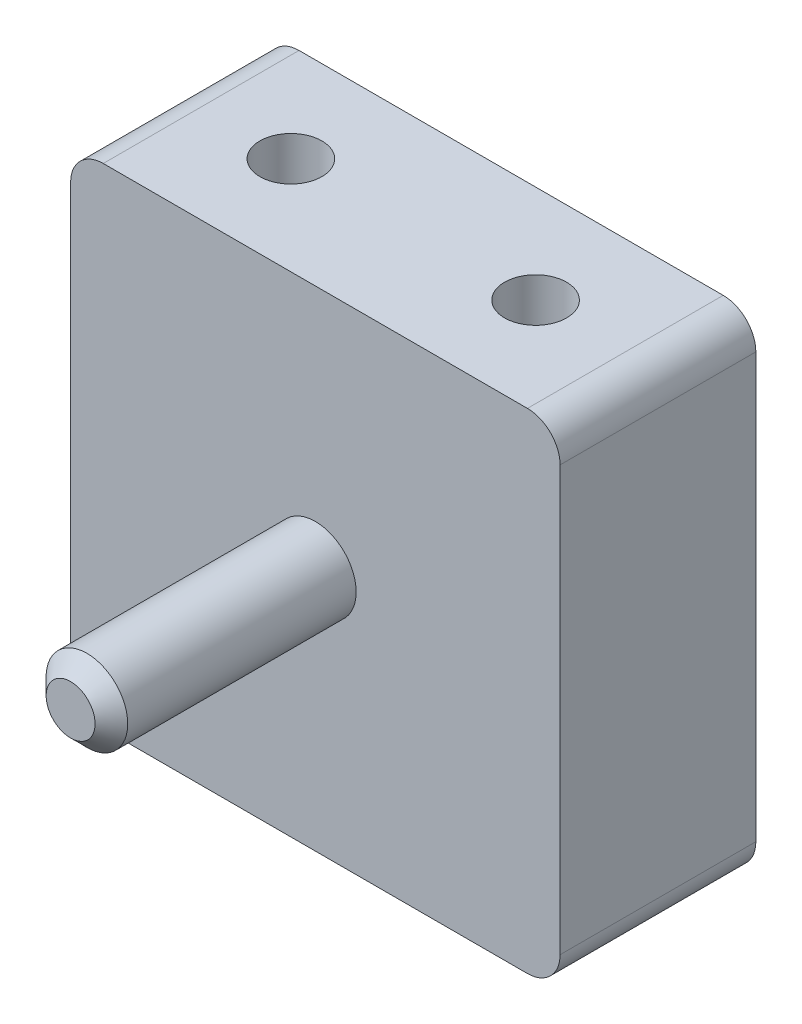
ISO-10303-21;
HEADER;
FILE_DESCRIPTION(('STEP AP214'),'2;1');
FILE_NAME('part.step','',(''),(''),'','','');
FILE_SCHEMA(('AUTOMOTIVE_DESIGN { 1 0 10303 214 1 1 1 1 }'));
ENDSEC;
DATA;
#1=APPLICATION_CONTEXT('core data for automotive mechanical design processes');
#2=APPLICATION_PROTOCOL_DEFINITION('international standard','automotive_design',2000,#1);
#3=PRODUCT_CONTEXT('',#1,'mechanical');
#4=PRODUCT('Part','Part','',(#3));
#5=PRODUCT_RELATED_PRODUCT_CATEGORY('part','',(#4));
#6=PRODUCT_DEFINITION_FORMATION('','',#4);
#7=PRODUCT_DEFINITION_CONTEXT('part definition',#1,'design');
#8=PRODUCT_DEFINITION('design','',#6,#7);
#9=PRODUCT_DEFINITION_SHAPE('','',#8);
#10=(LENGTH_UNIT() NAMED_UNIT(*) SI_UNIT(.MILLI.,.METRE.));
#11=(NAMED_UNIT(*) PLANE_ANGLE_UNIT() SI_UNIT($,.RADIAN.));
#12=(NAMED_UNIT(*) SI_UNIT($,.STERADIAN.) SOLID_ANGLE_UNIT());
#13=UNCERTAINTY_MEASURE_WITH_UNIT(LENGTH_MEASURE(1.E-05),#10,'distance_accuracy_value','');
#14=(GEOMETRIC_REPRESENTATION_CONTEXT(3) GLOBAL_UNCERTAINTY_ASSIGNED_CONTEXT((#13)) GLOBAL_UNIT_ASSIGNED_CONTEXT((#10,
#11,#12)) REPRESENTATION_CONTEXT('',''));
#15=CARTESIAN_POINT('',(0.,0.,0.));
#16=DIRECTION('',(0.,0.,1.));
#17=DIRECTION('',(1.,0.,0.));
#18=AXIS2_PLACEMENT_3D('',#15,#16,#17);
#19=CARTESIAN_POINT('',(0.,0.,15.24));
#20=DIRECTION('',(0.,0.,1.));
#21=DIRECTION('',(1.,0.,0.));
#22=AXIS2_PLACEMENT_3D('',#19,#20,#21);
#23=PLANE('',#22);
#24=CARTESIAN_POINT('',(0.,0.,15.24));
#25=DIRECTION('',(0.,0.,1.));
#26=DIRECTION('',(1.,0.,0.));
#27=AXIS2_PLACEMENT_3D('',#24,#25,#26);
#28=CIRCLE('',#27,3.175);
#29=CARTESIAN_POINT('',(3.175,0.,15.24));
#30=VERTEX_POINT('',#29);
#31=EDGE_CURVE('E251',#30,#30,#28,.T.);
#32=ORIENTED_EDGE('',*,*,#31,.F.);
#33=EDGE_LOOP('',(#32));
#34=FACE_BOUND('',#33,.T.);
#35=DIRECTION('',(0.,-1.,0.));
#36=VECTOR('',#35,1.);
#37=CARTESIAN_POINT('',(-19.05,-19.05,15.24));
#38=LINE('',#37,#36);
#39=CARTESIAN_POINT('',(-19.05,16.51,15.24));
#40=VERTEX_POINT('',#39);
#41=CARTESIAN_POINT('',(-19.05,-16.51,15.24));
#42=VERTEX_POINT('',#41);
#43=EDGE_CURVE('E150',#40,#42,#38,.T.);
#44=ORIENTED_EDGE('',*,*,#43,.T.);
#45=CARTESIAN_POINT('',(-16.51,-16.51,15.24));
#46=DIRECTION('',(0.,0.,1.));
#47=DIRECTION('',(1.,0.,0.));
#48=AXIS2_PLACEMENT_3D('',#45,#46,#47);
#49=CIRCLE('',#48,2.54);
#50=CARTESIAN_POINT('',(-16.51,-19.05,15.24));
#51=VERTEX_POINT('',#50);
#52=EDGE_CURVE('E165',#42,#51,#49,.T.);
#53=ORIENTED_EDGE('',*,*,#52,.T.);
#54=DIRECTION('',(1.,0.,0.));
#55=VECTOR('',#54,1.);
#56=CARTESIAN_POINT('',(19.05,-19.05,15.24));
#57=LINE('',#56,#55);
#58=CARTESIAN_POINT('',(16.51,-19.05,15.24));
#59=VERTEX_POINT('',#58);
#60=EDGE_CURVE('E132',#51,#59,#57,.T.);
#61=ORIENTED_EDGE('',*,*,#60,.T.);
#62=CARTESIAN_POINT('',(16.51,-16.51,15.24));
#63=DIRECTION('',(0.,0.,1.));
#64=DIRECTION('',(1.,0.,0.));
#65=AXIS2_PLACEMENT_3D('',#62,#63,#64);
#66=CIRCLE('',#65,2.54);
#67=CARTESIAN_POINT('',(19.05,-16.51,15.24));
#68=VERTEX_POINT('',#67);
#69=EDGE_CURVE('E163',#59,#68,#66,.T.);
#70=ORIENTED_EDGE('',*,*,#69,.T.);
#71=DIRECTION('',(0.,1.,0.));
#72=VECTOR('',#71,1.);
#73=CARTESIAN_POINT('',(19.05,-19.05,15.24));
#74=LINE('',#73,#72);
#75=CARTESIAN_POINT('',(19.05,16.51,15.24));
#76=VERTEX_POINT('',#75);
#77=EDGE_CURVE('E239',#68,#76,#74,.T.);
#78=ORIENTED_EDGE('',*,*,#77,.T.);
#79=CARTESIAN_POINT('',(16.51,16.51,15.24));
#80=DIRECTION('',(0.,0.,1.));
#81=DIRECTION('',(1.,0.,0.));
#82=AXIS2_PLACEMENT_3D('',#79,#80,#81);
#83=CIRCLE('',#82,2.54);
#84=CARTESIAN_POINT('',(16.51,19.05,15.24));
#85=VERTEX_POINT('',#84);
#86=EDGE_CURVE('E67',#76,#85,#83,.T.);
#87=ORIENTED_EDGE('',*,*,#86,.T.);
#88=DIRECTION('',(-1.,0.,0.));
#89=VECTOR('',#88,1.);
#90=CARTESIAN_POINT('',(19.05,19.05,15.24));
#91=LINE('',#90,#89);
#92=CARTESIAN_POINT('',(-16.51,19.05,15.24));
#93=VERTEX_POINT('',#92);
#94=EDGE_CURVE('E151',#85,#93,#91,.T.);
#95=ORIENTED_EDGE('',*,*,#94,.T.);
#96=CARTESIAN_POINT('',(-16.51,16.51,15.24));
#97=DIRECTION('',(0.,0.,1.));
#98=DIRECTION('',(1.,0.,0.));
#99=AXIS2_PLACEMENT_3D('',#96,#97,#98);
#100=CIRCLE('',#99,2.54);
#101=EDGE_CURVE('E160',#93,#40,#100,.T.);
#102=ORIENTED_EDGE('',*,*,#101,.T.);
#103=EDGE_LOOP('',(#44,#53,#61,#70,#78,#87,#95,#102));
#104=FACE_BOUND('',#103,.T.);
#105=ADVANCED_FACE('F45',(#34,#104),#23,.T.);
#106=CARTESIAN_POINT('',(0.,0.,0.));
#107=DIRECTION('',(0.,0.,1.));
#108=DIRECTION('',(1.,0.,0.));
#109=AXIS2_PLACEMENT_3D('',#106,#107,#108);
#110=PLANE('',#109);
#111=DIRECTION('',(1.,0.,0.));
#112=VECTOR('',#111,1.);
#113=CARTESIAN_POINT('',(19.05,-19.05,0.));
#114=LINE('',#113,#112);
#115=CARTESIAN_POINT('',(-16.51,-19.05,0.));
#116=VERTEX_POINT('',#115);
#117=CARTESIAN_POINT('',(16.51,-19.05,0.));
#118=VERTEX_POINT('',#117);
#119=EDGE_CURVE('E129',#116,#118,#114,.T.);
#120=ORIENTED_EDGE('',*,*,#119,.F.);
#121=CARTESIAN_POINT('',(-16.51,-16.51,0.));
#122=DIRECTION('',(0.,0.,1.));
#123=DIRECTION('',(1.,0.,0.));
#124=AXIS2_PLACEMENT_3D('',#121,#122,#123);
#125=CIRCLE('',#124,2.54);
#126=CARTESIAN_POINT('',(-19.05,-16.51,0.));
#127=VERTEX_POINT('',#126);
#128=EDGE_CURVE('E112',#116,#127,#125,.F.);
#129=ORIENTED_EDGE('',*,*,#128,.T.);
#130=DIRECTION('',(0.,-1.,0.));
#131=VECTOR('',#130,1.);
#132=CARTESIAN_POINT('',(-19.05,-19.05,0.));
#133=LINE('',#132,#131);
#134=CARTESIAN_POINT('',(-19.05,16.51,0.));
#135=VERTEX_POINT('',#134);
#136=EDGE_CURVE('E140',#135,#127,#133,.T.);
#137=ORIENTED_EDGE('',*,*,#136,.F.);
#138=CARTESIAN_POINT('',(-16.51,16.51,0.));
#139=DIRECTION('',(0.,0.,1.));
#140=DIRECTION('',(1.,0.,0.));
#141=AXIS2_PLACEMENT_3D('',#138,#139,#140);
#142=CIRCLE('',#141,2.54);
#143=CARTESIAN_POINT('',(-16.51,19.05,0.));
#144=VERTEX_POINT('',#143);
#145=EDGE_CURVE('E133',#135,#144,#142,.F.);
#146=ORIENTED_EDGE('',*,*,#145,.T.);
#147=DIRECTION('',(-1.,0.,0.));
#148=VECTOR('',#147,1.);
#149=CARTESIAN_POINT('',(19.05,19.05,0.));
#150=LINE('',#149,#148);
#151=CARTESIAN_POINT('',(16.51,19.05,0.));
#152=VERTEX_POINT('',#151);
#153=EDGE_CURVE('E143',#152,#144,#150,.T.);
#154=ORIENTED_EDGE('',*,*,#153,.F.);
#155=CARTESIAN_POINT('',(16.51,16.51,0.));
#156=DIRECTION('',(0.,0.,1.));
#157=DIRECTION('',(1.,0.,0.));
#158=AXIS2_PLACEMENT_3D('',#155,#156,#157);
#159=CIRCLE('',#158,2.54);
#160=CARTESIAN_POINT('',(19.05,16.51,0.));
#161=VERTEX_POINT('',#160);
#162=EDGE_CURVE('E154',#152,#161,#159,.F.);
#163=ORIENTED_EDGE('',*,*,#162,.T.);
#164=DIRECTION('',(0.,1.,0.));
#165=VECTOR('',#164,1.);
#166=CARTESIAN_POINT('',(19.05,-19.05,0.));
#167=LINE('',#166,#165);
#168=CARTESIAN_POINT('',(19.05,-16.51,0.));
#169=VERTEX_POINT('',#168);
#170=EDGE_CURVE('E139',#169,#161,#167,.T.);
#171=ORIENTED_EDGE('',*,*,#170,.F.);
#172=CARTESIAN_POINT('',(16.51,-16.51,0.));
#173=DIRECTION('',(0.,0.,1.));
#174=DIRECTION('',(1.,0.,0.));
#175=AXIS2_PLACEMENT_3D('',#172,#173,#174);
#176=CIRCLE('',#175,2.54);
#177=EDGE_CURVE('E123',#169,#118,#176,.F.);
#178=ORIENTED_EDGE('',*,*,#177,.T.);
#179=EDGE_LOOP('',(#120,#129,#137,#146,#154,#163,#171,#178));
#180=FACE_BOUND('',#179,.T.);
#181=CARTESIAN_POINT('',(0.,0.,0.));
#182=DIRECTION('',(0.,0.,1.));
#183=DIRECTION('',(1.,0.,0.));
#184=AXIS2_PLACEMENT_3D('',#181,#182,#183);
#185=CIRCLE('',#184,1.5875);
#186=CARTESIAN_POINT('',(1.5875,0.,0.));
#187=VERTEX_POINT('',#186);
#188=EDGE_CURVE('E145',#187,#187,#185,.T.);
#189=ORIENTED_EDGE('',*,*,#188,.T.);
#190=EDGE_LOOP('',(#189));
#191=FACE_BOUND('',#190,.T.);
#192=ADVANCED_FACE('F136',(#180,#191),#110,.F.);
#193=CARTESIAN_POINT('',(-19.05,-19.05,15.24));
#194=DIRECTION('',(1.,0.,0.));
#195=DIRECTION('',(0.,0.,-1.));
#196=AXIS2_PLACEMENT_3D('',#193,#194,#195);
#197=PLANE('',#196);
#198=ORIENTED_EDGE('',*,*,#136,.T.);
#199=DIRECTION('',(0.,0.,-1.));
#200=VECTOR('',#199,1.);
#201=CARTESIAN_POINT('',(-19.05,-16.51,15.24));
#202=LINE('',#201,#200);
#203=EDGE_CURVE('E117',#127,#42,#202,.F.);
#204=ORIENTED_EDGE('',*,*,#203,.T.);
#205=ORIENTED_EDGE('',*,*,#43,.F.);
#206=DIRECTION('',(0.,0.,-1.));
#207=VECTOR('',#206,1.);
#208=CARTESIAN_POINT('',(-19.05,16.51,15.24));
#209=LINE('',#208,#207);
#210=EDGE_CURVE('E122',#40,#135,#209,.T.);
#211=ORIENTED_EDGE('',*,*,#210,.T.);
#212=EDGE_LOOP('',(#198,#204,#205,#211));
#213=FACE_BOUND('',#212,.T.);
#214=ADVANCED_FACE('F200',(#213),#197,.F.);
#215=CARTESIAN_POINT('',(19.05,-19.05,15.24));
#216=DIRECTION('',(0.,1.,0.));
#217=DIRECTION('',(-1.,0.,0.));
#218=AXIS2_PLACEMENT_3D('',#215,#216,#217);
#219=PLANE('',#218);
#220=CARTESIAN_POINT('',(-9.525,-19.05,7.62));
#221=DIRECTION('',(0.,-1.,0.));
#222=DIRECTION('',(1.,0.,0.));
#223=AXIS2_PLACEMENT_3D('',#220,#221,#222);
#224=CIRCLE('',#223,2.413);
#225=CARTESIAN_POINT('',(-7.112,-19.05,7.62));
#226=VERTEX_POINT('',#225);
#227=EDGE_CURVE('E262',#226,#226,#224,.T.);
#228=ORIENTED_EDGE('',*,*,#227,.F.);
#229=EDGE_LOOP('',(#228));
#230=FACE_BOUND('',#229,.T.);
#231=CARTESIAN_POINT('',(9.525,-19.05,7.62));
#232=DIRECTION('',(0.,-1.,0.));
#233=DIRECTION('',(1.,0.,0.));
#234=AXIS2_PLACEMENT_3D('',#231,#232,#233);
#235=CIRCLE('',#234,2.413);
#236=CARTESIAN_POINT('',(11.938,-19.05,7.62));
#237=VERTEX_POINT('',#236);
#238=EDGE_CURVE('E258',#237,#237,#235,.T.);
#239=ORIENTED_EDGE('',*,*,#238,.F.);
#240=EDGE_LOOP('',(#239));
#241=FACE_BOUND('',#240,.T.);
#242=ORIENTED_EDGE('',*,*,#60,.F.);
#243=DIRECTION('',(0.,0.,-1.));
#244=VECTOR('',#243,1.);
#245=CARTESIAN_POINT('',(-16.51,-19.05,15.24));
#246=LINE('',#245,#244);
#247=EDGE_CURVE('E116',#51,#116,#246,.T.);
#248=ORIENTED_EDGE('',*,*,#247,.T.);
#249=ORIENTED_EDGE('',*,*,#119,.T.);
#250=DIRECTION('',(0.,0.,-1.));
#251=VECTOR('',#250,1.);
#252=CARTESIAN_POINT('',(16.51,-19.05,15.24));
#253=LINE('',#252,#251);
#254=EDGE_CURVE('E134',#118,#59,#253,.F.);
#255=ORIENTED_EDGE('',*,*,#254,.T.);
#256=EDGE_LOOP('',(#242,#248,#249,#255));
#257=FACE_BOUND('',#256,.T.);
#258=ADVANCED_FACE('F128',(#230,#241,#257),#219,.F.);
#259=CARTESIAN_POINT('',(19.05,-19.05,15.24));
#260=DIRECTION('',(-1.,0.,0.));
#261=DIRECTION('',(0.,0.,1.));
#262=AXIS2_PLACEMENT_3D('',#259,#260,#261);
#263=PLANE('',#262);
#264=ORIENTED_EDGE('',*,*,#77,.F.);
#265=DIRECTION('',(0.,0.,-1.));
#266=VECTOR('',#265,1.);
#267=CARTESIAN_POINT('',(19.05,-16.51,15.24));
#268=LINE('',#267,#266);
#269=EDGE_CURVE('E169',#68,#169,#268,.T.);
#270=ORIENTED_EDGE('',*,*,#269,.T.);
#271=ORIENTED_EDGE('',*,*,#170,.T.);
#272=DIRECTION('',(0.,0.,-1.));
#273=VECTOR('',#272,1.);
#274=CARTESIAN_POINT('',(19.05,16.51,15.24));
#275=LINE('',#274,#273);
#276=EDGE_CURVE('E167',#161,#76,#275,.F.);
#277=ORIENTED_EDGE('',*,*,#276,.T.);
#278=EDGE_LOOP('',(#264,#270,#271,#277));
#279=FACE_BOUND('',#278,.T.);
#280=ADVANCED_FACE('F210',(#279),#263,.F.);
#281=CARTESIAN_POINT('',(19.05,19.05,15.24));
#282=DIRECTION('',(0.,-1.,0.));
#283=DIRECTION('',(1.,0.,0.));
#284=AXIS2_PLACEMENT_3D('',#281,#282,#283);
#285=PLANE('',#284);
#286=CARTESIAN_POINT('',(9.525,19.05,7.62));
#287=DIRECTION('',(0.,1.,0.));
#288=DIRECTION('',(-1.,0.,0.));
#289=AXIS2_PLACEMENT_3D('',#286,#287,#288);
#290=CIRCLE('',#289,2.413);
#291=CARTESIAN_POINT('',(7.112,19.05,7.62));
#292=VERTEX_POINT('',#291);
#293=EDGE_CURVE('E273',#292,#292,#290,.T.);
#294=ORIENTED_EDGE('',*,*,#293,.F.);
#295=EDGE_LOOP('',(#294));
#296=FACE_BOUND('',#295,.T.);
#297=CARTESIAN_POINT('',(-9.525,19.05,7.62));
#298=DIRECTION('',(0.,1.,0.));
#299=DIRECTION('',(-1.,0.,0.));
#300=AXIS2_PLACEMENT_3D('',#297,#298,#299);
#301=CIRCLE('',#300,2.413);
#302=CARTESIAN_POINT('',(-11.938,19.05,7.62));
#303=VERTEX_POINT('',#302);
#304=EDGE_CURVE('E270',#303,#303,#301,.T.);
#305=ORIENTED_EDGE('',*,*,#304,.F.);
#306=EDGE_LOOP('',(#305));
#307=FACE_BOUND('',#306,.T.);
#308=ORIENTED_EDGE('',*,*,#94,.F.);
#309=DIRECTION('',(0.,0.,-1.));
#310=VECTOR('',#309,1.);
#311=CARTESIAN_POINT('',(16.51,19.05,15.24));
#312=LINE('',#311,#310);
#313=EDGE_CURVE('E173',#85,#152,#312,.T.);
#314=ORIENTED_EDGE('',*,*,#313,.T.);
#315=ORIENTED_EDGE('',*,*,#153,.T.);
#316=DIRECTION('',(0.,0.,-1.));
#317=VECTOR('',#316,1.);
#318=CARTESIAN_POINT('',(-16.51,19.05,15.24));
#319=LINE('',#318,#317);
#320=EDGE_CURVE('E60',#144,#93,#319,.F.);
#321=ORIENTED_EDGE('',*,*,#320,.T.);
#322=EDGE_LOOP('',(#308,#314,#315,#321));
#323=FACE_BOUND('',#322,.T.);
#324=ADVANCED_FACE('F207',(#296,#307,#323),#285,.F.);
#325=CARTESIAN_POINT('',(0.,0.,15.24));
#326=DIRECTION('',(0.,0.,-1.));
#327=DIRECTION('',(-1.,0.,0.));
#328=AXIS2_PLACEMENT_3D('',#325,#326,#327);
#329=CYLINDRICAL_SURFACE('',#328,1.5875);
#330=CARTESIAN_POINT('',(0.,0.,15.24));
#331=DIRECTION('',(0.,0.,1.));
#332=DIRECTION('',(1.,0.,0.));
#333=AXIS2_PLACEMENT_3D('',#330,#331,#332);
#334=CIRCLE('',#333,1.5875);
#335=CARTESIAN_POINT('',(1.5875,0.,15.24));
#336=VERTEX_POINT('',#335);
#337=EDGE_CURVE('E248',#336,#336,#334,.T.);
#338=ORIENTED_EDGE('',*,*,#337,.T.);
#339=EDGE_LOOP('',(#338));
#340=FACE_BOUND('',#339,.T.);
#341=ORIENTED_EDGE('',*,*,#188,.F.);
#342=EDGE_LOOP('',(#341));
#343=FACE_BOUND('',#342,.T.);
#344=ADVANCED_FACE('F204',(#340,#343),#329,.F.);
#345=CARTESIAN_POINT('',(0.,0.,15.24));
#346=DIRECTION('',(0.,0.,1.));
#347=DIRECTION('',(1.,0.,0.));
#348=AXIS2_PLACEMENT_3D('',#345,#346,#347);
#349=PLANE('',#348);
#350=ORIENTED_EDGE('',*,*,#337,.F.);
#351=EDGE_LOOP('',(#350));
#352=FACE_BOUND('',#351,.T.);
#353=ADVANCED_FACE('F316',(#352),#349,.F.);
#354=CARTESIAN_POINT('',(0.,0.,34.29));
#355=DIRECTION('',(0.,0.,-1.));
#356=DIRECTION('',(-1.,0.,0.));
#357=AXIS2_PLACEMENT_3D('',#354,#355,#356);
#358=CYLINDRICAL_SURFACE('',#357,3.175);
#359=CARTESIAN_POINT('',(0.,0.,33.02));
#360=DIRECTION('',(0.,0.,1.));
#361=DIRECTION('',(1.,0.,0.));
#362=AXIS2_PLACEMENT_3D('',#359,#360,#361);
#363=CIRCLE('',#362,3.175);
#364=CARTESIAN_POINT('',(3.175,0.,33.02));
#365=VERTEX_POINT('',#364);
#366=EDGE_CURVE('E13',#365,#365,#363,.F.);
#367=ORIENTED_EDGE('',*,*,#366,.T.);
#368=EDGE_LOOP('',(#367));
#369=FACE_BOUND('',#368,.T.);
#370=ORIENTED_EDGE('',*,*,#31,.T.);
#371=EDGE_LOOP('',(#370));
#372=FACE_BOUND('',#371,.T.);
#373=ADVANCED_FACE('F315',(#369,#372),#358,.T.);
#374=CARTESIAN_POINT('',(0.,0.,34.29));
#375=DIRECTION('',(0.,0.,1.));
#376=DIRECTION('',(1.,0.,0.));
#377=AXIS2_PLACEMENT_3D('',#374,#375,#376);
#378=PLANE('',#377);
#379=CARTESIAN_POINT('',(0.,0.,34.29));
#380=DIRECTION('',(0.,0.,1.));
#381=DIRECTION('',(1.,0.,0.));
#382=AXIS2_PLACEMENT_3D('',#379,#380,#381);
#383=CIRCLE('',#382,1.90500000000002);
#384=CARTESIAN_POINT('',(1.90500000000002,0.,34.29));
#385=VERTEX_POINT('',#384);
#386=EDGE_CURVE('E53',#385,#385,#383,.T.);
#387=ORIENTED_EDGE('',*,*,#386,.T.);
#388=EDGE_LOOP('',(#387));
#389=FACE_BOUND('',#388,.T.);
#390=ADVANCED_FACE('F178',(#389),#378,.T.);
#391=CARTESIAN_POINT('',(-16.51,-16.51,15.24));
#392=DIRECTION('',(0.,0.,-1.));
#393=DIRECTION('',(-1.,0.,0.));
#394=AXIS2_PLACEMENT_3D('',#391,#392,#393);
#395=CYLINDRICAL_SURFACE('',#394,2.54);
#396=ORIENTED_EDGE('',*,*,#52,.F.);
#397=ORIENTED_EDGE('',*,*,#203,.F.);
#398=ORIENTED_EDGE('',*,*,#128,.F.);
#399=ORIENTED_EDGE('',*,*,#247,.F.);
#400=EDGE_LOOP('',(#396,#397,#398,#399));
#401=FACE_BOUND('',#400,.T.);
#402=ADVANCED_FACE('F115',(#401),#395,.T.);
#403=CARTESIAN_POINT('',(16.51,-16.51,15.24));
#404=DIRECTION('',(0.,0.,-1.));
#405=DIRECTION('',(-1.,0.,0.));
#406=AXIS2_PLACEMENT_3D('',#403,#404,#405);
#407=CYLINDRICAL_SURFACE('',#406,2.54);
#408=ORIENTED_EDGE('',*,*,#69,.F.);
#409=ORIENTED_EDGE('',*,*,#254,.F.);
#410=ORIENTED_EDGE('',*,*,#177,.F.);
#411=ORIENTED_EDGE('',*,*,#269,.F.);
#412=EDGE_LOOP('',(#408,#409,#410,#411));
#413=FACE_BOUND('',#412,.T.);
#414=ADVANCED_FACE('F223',(#413),#407,.T.);
#415=CARTESIAN_POINT('',(16.51,16.51,15.24));
#416=DIRECTION('',(0.,0.,-1.));
#417=DIRECTION('',(-1.,0.,0.));
#418=AXIS2_PLACEMENT_3D('',#415,#416,#417);
#419=CYLINDRICAL_SURFACE('',#418,2.54);
#420=ORIENTED_EDGE('',*,*,#86,.F.);
#421=ORIENTED_EDGE('',*,*,#276,.F.);
#422=ORIENTED_EDGE('',*,*,#162,.F.);
#423=ORIENTED_EDGE('',*,*,#313,.F.);
#424=EDGE_LOOP('',(#420,#421,#422,#423));
#425=FACE_BOUND('',#424,.T.);
#426=ADVANCED_FACE('F191',(#425),#419,.T.);
#427=CARTESIAN_POINT('',(-16.51,16.51,15.24));
#428=DIRECTION('',(0.,0.,-1.));
#429=DIRECTION('',(-1.,0.,0.));
#430=AXIS2_PLACEMENT_3D('',#427,#428,#429);
#431=CYLINDRICAL_SURFACE('',#430,2.54);
#432=ORIENTED_EDGE('',*,*,#101,.F.);
#433=ORIENTED_EDGE('',*,*,#320,.F.);
#434=ORIENTED_EDGE('',*,*,#145,.F.);
#435=ORIENTED_EDGE('',*,*,#210,.F.);
#436=EDGE_LOOP('',(#432,#433,#434,#435));
#437=FACE_BOUND('',#436,.T.);
#438=ADVANCED_FACE('F182',(#437),#431,.T.);
#439=CARTESIAN_POINT('',(0.,0.,34.29));
#440=DIRECTION('',(0.,0.,-1.));
#441=DIRECTION('',(-1.,0.,0.));
#442=AXIS2_PLACEMENT_3D('',#439,#440,#441);
#443=CONICAL_SURFACE('',#442,1.90500000000002,0.785398163397447);
#444=ORIENTED_EDGE('',*,*,#366,.F.);
#445=EDGE_LOOP('',(#444));
#446=FACE_BOUND('',#445,.T.);
#447=ORIENTED_EDGE('',*,*,#386,.F.);
#448=EDGE_LOOP('',(#447));
#449=FACE_BOUND('',#448,.T.);
#450=ADVANCED_FACE('F47',(#446,#449),#443,.T.);
#451=CARTESIAN_POINT('',(9.525,-11.43,7.62));
#452=DIRECTION('',(0.,-1.,0.));
#453=DIRECTION('',(1.,0.,0.));
#454=AXIS2_PLACEMENT_3D('',#451,#452,#453);
#455=CYLINDRICAL_SURFACE('',#454,2.413);
#456=CARTESIAN_POINT('',(9.525,-11.43,7.62));
#457=DIRECTION('',(0.,-1.,0.));
#458=DIRECTION('',(1.,0.,0.));
#459=AXIS2_PLACEMENT_3D('',#456,#457,#458);
#460=CIRCLE('',#459,2.413);
#461=CARTESIAN_POINT('',(11.938,-11.43,7.62));
#462=VERTEX_POINT('',#461);
#463=EDGE_CURVE('E255',#462,#462,#460,.T.);
#464=ORIENTED_EDGE('',*,*,#463,.F.);
#465=EDGE_LOOP('',(#464));
#466=FACE_BOUND('',#465,.T.);
#467=ORIENTED_EDGE('',*,*,#238,.T.);
#468=EDGE_LOOP('',(#467));
#469=FACE_BOUND('',#468,.T.);
#470=ADVANCED_FACE('F181',(#466,#469),#455,.F.);
#471=CARTESIAN_POINT('',(9.525,-11.43,7.62));
#472=DIRECTION('',(0.,-1.,0.));
#473=DIRECTION('',(1.,0.,0.));
#474=AXIS2_PLACEMENT_3D('',#471,#472,#473);
#475=PLANE('',#474);
#476=ORIENTED_EDGE('',*,*,#463,.T.);
#477=EDGE_LOOP('',(#476));
#478=FACE_BOUND('',#477,.T.);
#479=ADVANCED_FACE('F188',(#478),#475,.T.);
#480=CARTESIAN_POINT('',(-9.525,-11.43,7.62));
#481=DIRECTION('',(0.,-1.,0.));
#482=DIRECTION('',(1.,0.,0.));
#483=AXIS2_PLACEMENT_3D('',#480,#481,#482);
#484=CYLINDRICAL_SURFACE('',#483,2.413);
#485=CARTESIAN_POINT('',(-9.525,-11.43,7.62));
#486=DIRECTION('',(0.,-1.,0.));
#487=DIRECTION('',(1.,0.,0.));
#488=AXIS2_PLACEMENT_3D('',#485,#486,#487);
#489=CIRCLE('',#488,2.413);
#490=CARTESIAN_POINT('',(-7.112,-11.43,7.62));
#491=VERTEX_POINT('',#490);
#492=EDGE_CURVE('E254',#491,#491,#489,.T.);
#493=ORIENTED_EDGE('',*,*,#492,.F.);
#494=EDGE_LOOP('',(#493));
#495=FACE_BOUND('',#494,.T.);
#496=ORIENTED_EDGE('',*,*,#227,.T.);
#497=EDGE_LOOP('',(#496));
#498=FACE_BOUND('',#497,.T.);
#499=ADVANCED_FACE('F301',(#495,#498),#484,.F.);
#500=CARTESIAN_POINT('',(-9.525,-11.43,7.62));
#501=DIRECTION('',(0.,-1.,0.));
#502=DIRECTION('',(1.,0.,0.));
#503=AXIS2_PLACEMENT_3D('',#500,#501,#502);
#504=PLANE('',#503);
#505=ORIENTED_EDGE('',*,*,#492,.T.);
#506=EDGE_LOOP('',(#505));
#507=FACE_BOUND('',#506,.T.);
#508=ADVANCED_FACE('F292',(#507),#504,.T.);
#509=CARTESIAN_POINT('',(-9.525,11.43,7.62));
#510=DIRECTION('',(0.,1.,0.));
#511=DIRECTION('',(-1.,0.,0.));
#512=AXIS2_PLACEMENT_3D('',#509,#510,#511);
#513=CYLINDRICAL_SURFACE('',#512,2.413);
#514=CARTESIAN_POINT('',(-9.525,11.43,7.62));
#515=DIRECTION('',(0.,1.,0.));
#516=DIRECTION('',(-1.,0.,0.));
#517=AXIS2_PLACEMENT_3D('',#514,#515,#516);
#518=CIRCLE('',#517,2.413);
#519=CARTESIAN_POINT('',(-11.938,11.43,7.62));
#520=VERTEX_POINT('',#519);
#521=EDGE_CURVE('E267',#520,#520,#518,.T.);
#522=ORIENTED_EDGE('',*,*,#521,.F.);
#523=EDGE_LOOP('',(#522));
#524=FACE_BOUND('',#523,.T.);
#525=ORIENTED_EDGE('',*,*,#304,.T.);
#526=EDGE_LOOP('',(#525));
#527=FACE_BOUND('',#526,.T.);
#528=ADVANCED_FACE('F290',(#524,#527),#513,.F.);
#529=CARTESIAN_POINT('',(-9.525,11.43,7.62));
#530=DIRECTION('',(0.,1.,0.));
#531=DIRECTION('',(-1.,0.,0.));
#532=AXIS2_PLACEMENT_3D('',#529,#530,#531);
#533=PLANE('',#532);
#534=ORIENTED_EDGE('',*,*,#521,.T.);
#535=EDGE_LOOP('',(#534));
#536=FACE_BOUND('',#535,.T.);
#537=ADVANCED_FACE('F284',(#536),#533,.T.);
#538=CARTESIAN_POINT('',(9.525,11.43,7.62));
#539=DIRECTION('',(0.,1.,0.));
#540=DIRECTION('',(-1.,0.,0.));
#541=AXIS2_PLACEMENT_3D('',#538,#539,#540);
#542=CYLINDRICAL_SURFACE('',#541,2.413);
#543=CARTESIAN_POINT('',(9.525,11.43,7.62));
#544=DIRECTION('',(0.,1.,0.));
#545=DIRECTION('',(-1.,0.,0.));
#546=AXIS2_PLACEMENT_3D('',#543,#544,#545);
#547=CIRCLE('',#546,2.413);
#548=CARTESIAN_POINT('',(7.112,11.43,7.62));
#549=VERTEX_POINT('',#548);
#550=EDGE_CURVE('E259',#549,#549,#547,.T.);
#551=ORIENTED_EDGE('',*,*,#550,.F.);
#552=EDGE_LOOP('',(#551));
#553=FACE_BOUND('',#552,.T.);
#554=ORIENTED_EDGE('',*,*,#293,.T.);
#555=EDGE_LOOP('',(#554));
#556=FACE_BOUND('',#555,.T.);
#557=ADVANCED_FACE('F281',(#553,#556),#542,.F.);
#558=CARTESIAN_POINT('',(9.525,11.43,7.62));
#559=DIRECTION('',(0.,1.,0.));
#560=DIRECTION('',(-1.,0.,0.));
#561=AXIS2_PLACEMENT_3D('',#558,#559,#560);
#562=PLANE('',#561);
#563=ORIENTED_EDGE('',*,*,#550,.T.);
#564=EDGE_LOOP('',(#563));
#565=FACE_BOUND('',#564,.T.);
#566=ADVANCED_FACE('F279',(#565),#562,.T.);
#567=CLOSED_SHELL('',(#105,#192,#214,#258,#280,#324,#344,#353,#373,#390,#402,#414,#426,#438,
#450,#470,#479,#499,#508,#528,#537,#557,#566));
#568=MANIFOLD_SOLID_BREP('B2',#567);
#569=ADVANCED_BREP_SHAPE_REPRESENTATION('',(#18,#568),#14);
#570=SHAPE_DEFINITION_REPRESENTATION(#9,#569);
ENDSEC;
END-ISO-10303-21;
